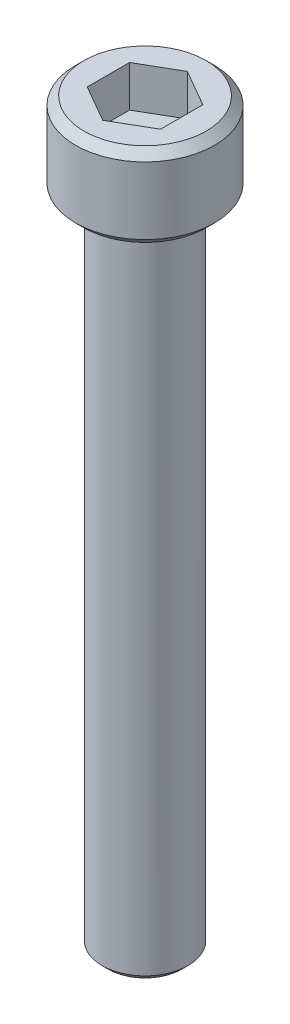
ISO-10303-21;
HEADER;
FILE_DESCRIPTION(('STEP AP214'),'2;1');
FILE_NAME('part.step','',(''),(''),'','','');
FILE_SCHEMA(('AUTOMOTIVE_DESIGN { 1 0 10303 214 1 1 1 1 }'));
ENDSEC;
DATA;
#1=APPLICATION_CONTEXT('core data for automotive mechanical design processes');
#2=APPLICATION_PROTOCOL_DEFINITION('international standard','automotive_design',2000,#1);
#3=PRODUCT_CONTEXT('',#1,'mechanical');
#4=PRODUCT('Part','Part','',(#3));
#5=PRODUCT_RELATED_PRODUCT_CATEGORY('part','',(#4));
#6=PRODUCT_DEFINITION_FORMATION('','',#4);
#7=PRODUCT_DEFINITION_CONTEXT('part definition',#1,'design');
#8=PRODUCT_DEFINITION('design','',#6,#7);
#9=PRODUCT_DEFINITION_SHAPE('','',#8);
#10=(LENGTH_UNIT() NAMED_UNIT(*) SI_UNIT(.MILLI.,.METRE.));
#11=(NAMED_UNIT(*) PLANE_ANGLE_UNIT() SI_UNIT($,.RADIAN.));
#12=(NAMED_UNIT(*) SI_UNIT($,.STERADIAN.) SOLID_ANGLE_UNIT());
#13=UNCERTAINTY_MEASURE_WITH_UNIT(LENGTH_MEASURE(1.E-05),#10,'distance_accuracy_value','');
#14=(GEOMETRIC_REPRESENTATION_CONTEXT(3) GLOBAL_UNCERTAINTY_ASSIGNED_CONTEXT((#13)) GLOBAL_UNIT_ASSIGNED_CONTEXT((#10,
#11,#12)) REPRESENTATION_CONTEXT('',''));
#15=CARTESIAN_POINT('',(0.,0.,0.));
#16=DIRECTION('',(0.,0.,1.));
#17=DIRECTION('',(1.,0.,0.));
#18=AXIS2_PLACEMENT_3D('',#15,#16,#17);
#19=CARTESIAN_POINT('',(1.77799999999999,2.064,3.07958633585744));
#20=DIRECTION('',(0.,1.,0.));
#21=DIRECTION('',(-1.,0.,0.));
#22=AXIS2_PLACEMENT_3D('',#19,#20,#21);
#23=PLANE('',#22);
#24=DIRECTION('',(-0.866025403784438,0.,0.5));
#25=VECTOR('',#24,1.);
#26=CARTESIAN_POINT('',(0.,2.064,-2.05305755723831));
#27=LINE('',#26,#25);
#28=CARTESIAN_POINT('',(0.,2.064,-2.05305755723831));
#29=VERTEX_POINT('',#28);
#30=CARTESIAN_POINT('',(-1.778,2.064,-1.02652877861915));
#31=VERTEX_POINT('',#30);
#32=EDGE_CURVE('E81',#29,#31,#27,.T.);
#33=ORIENTED_EDGE('',*,*,#32,.T.);
#34=DIRECTION('',(0.,0.,1.));
#35=VECTOR('',#34,1.);
#36=CARTESIAN_POINT('',(-1.778,2.064,-1.02652877861915));
#37=LINE('',#36,#35);
#38=CARTESIAN_POINT('',(-1.778,2.064,1.02652877861915));
#39=VERTEX_POINT('',#38);
#40=EDGE_CURVE('E83',#31,#39,#37,.T.);
#41=ORIENTED_EDGE('',*,*,#40,.T.);
#42=DIRECTION('',(0.866025403784439,0.,0.5));
#43=VECTOR('',#42,1.);
#44=CARTESIAN_POINT('',(-1.778,2.064,1.02652877861915));
#45=LINE('',#44,#43);
#46=CARTESIAN_POINT('',(0.,2.064,2.05305755723829));
#47=VERTEX_POINT('',#46);
#48=EDGE_CURVE('E85',#39,#47,#45,.T.);
#49=ORIENTED_EDGE('',*,*,#48,.T.);
#50=DIRECTION('',(0.866025403784438,0.,-0.500000000000001));
#51=VECTOR('',#50,1.);
#52=CARTESIAN_POINT('',(0.,2.064,2.05305755723828));
#53=LINE('',#52,#51);
#54=CARTESIAN_POINT('',(1.77799999999999,2.064,1.02652877861912));
#55=VERTEX_POINT('',#54);
#56=EDGE_CURVE('E159',#47,#55,#53,.T.);
#57=ORIENTED_EDGE('',*,*,#56,.T.);
#58=DIRECTION('',(0.,0.,1.));
#59=VECTOR('',#58,1.);
#60=CARTESIAN_POINT('',(1.77799999999999,2.064,1.02652877861912));
#61=LINE('',#60,#59);
#62=CARTESIAN_POINT('',(1.77799999999999,2.064,-1.02652877861916));
#63=VERTEX_POINT('',#62);
#64=EDGE_CURVE('E167',#55,#63,#61,.F.);
#65=ORIENTED_EDGE('',*,*,#64,.T.);
#66=DIRECTION('',(-0.866025403784439,0.,-0.5));
#67=VECTOR('',#66,1.);
#68=CARTESIAN_POINT('',(1.778,2.064,-1.02652877861916));
#69=LINE('',#68,#67);
#70=EDGE_CURVE('E172',#63,#29,#69,.T.);
#71=ORIENTED_EDGE('',*,*,#70,.T.);
#72=EDGE_LOOP('',(#33,#41,#49,#57,#65,#71));
#73=FACE_BOUND('',#72,.T.);
#74=ADVANCED_FACE('F16',(#73),#23,.T.);
#75=CARTESIAN_POINT('',(-1.778,2.064,1.02652877861915));
#76=DIRECTION('',(-0.5,0.,0.866025403784439));
#77=DIRECTION('',(0.866025403784439,0.,0.5));
#78=AXIS2_PLACEMENT_3D('',#75,#76,#77);
#79=PLANE('',#78);
#80=DIRECTION('',(0.,1.,0.));
#81=VECTOR('',#80,1.);
#82=CARTESIAN_POINT('',(0.,2.064,2.05305755723828));
#83=LINE('',#82,#81);
#84=CARTESIAN_POINT('',(0.,4.064,2.05305755723829));
#85=VERTEX_POINT('',#84);
#86=EDGE_CURVE('E97',#85,#47,#83,.F.);
#87=ORIENTED_EDGE('',*,*,#86,.T.);
#88=ORIENTED_EDGE('',*,*,#48,.F.);
#89=DIRECTION('',(0.,1.,0.));
#90=VECTOR('',#89,1.);
#91=CARTESIAN_POINT('',(-1.778,2.064,1.02652877861915));
#92=LINE('',#91,#90);
#93=CARTESIAN_POINT('',(-1.778,4.064,1.02652877861915));
#94=VERTEX_POINT('',#93);
#95=EDGE_CURVE('E91',#39,#94,#92,.T.);
#96=ORIENTED_EDGE('',*,*,#95,.T.);
#97=DIRECTION('',(-0.866025403784443,0.,-0.499999999999993));
#98=VECTOR('',#97,1.);
#99=CARTESIAN_POINT('',(0.,4.064,2.05305755723828));
#100=LINE('',#99,#98);
#101=EDGE_CURVE('E154',#85,#94,#100,.T.);
#102=ORIENTED_EDGE('',*,*,#101,.F.);
#103=EDGE_LOOP('',(#87,#88,#96,#102));
#104=FACE_BOUND('',#103,.T.);
#105=ADVANCED_FACE('F94',(#104),#79,.F.);
#106=CARTESIAN_POINT('',(-1.778,2.064,-1.02652877861915));
#107=DIRECTION('',(-1.,0.,0.));
#108=DIRECTION('',(0.,0.,1.));
#109=AXIS2_PLACEMENT_3D('',#106,#107,#108);
#110=PLANE('',#109);
#111=ORIENTED_EDGE('',*,*,#95,.F.);
#112=ORIENTED_EDGE('',*,*,#40,.F.);
#113=DIRECTION('',(0.,1.,0.));
#114=VECTOR('',#113,1.);
#115=CARTESIAN_POINT('',(-1.778,2.064,-1.02652877861916));
#116=LINE('',#115,#114);
#117=CARTESIAN_POINT('',(-1.778,4.064,-1.02652877861915));
#118=VERTEX_POINT('',#117);
#119=EDGE_CURVE('E111',#31,#118,#116,.T.);
#120=ORIENTED_EDGE('',*,*,#119,.T.);
#121=DIRECTION('',(0.,0.,1.));
#122=VECTOR('',#121,1.);
#123=CARTESIAN_POINT('',(-1.778,4.064,0.));
#124=LINE('',#123,#122);
#125=EDGE_CURVE('E103',#94,#118,#124,.F.);
#126=ORIENTED_EDGE('',*,*,#125,.F.);
#127=EDGE_LOOP('',(#111,#112,#120,#126));
#128=FACE_BOUND('',#127,.T.);
#129=ADVANCED_FACE('F101',(#128),#110,.F.);
#130=CARTESIAN_POINT('',(0.,2.064,-2.05305755723831));
#131=DIRECTION('',(-0.5,0.,-0.866025403784438));
#132=DIRECTION('',(-0.866025403784438,0.,0.5));
#133=AXIS2_PLACEMENT_3D('',#130,#131,#132);
#134=PLANE('',#133);
#135=ORIENTED_EDGE('',*,*,#119,.F.);
#136=ORIENTED_EDGE('',*,*,#32,.F.);
#137=DIRECTION('',(0.,1.,0.));
#138=VECTOR('',#137,1.);
#139=CARTESIAN_POINT('',(0.,2.064,-2.05305755723831));
#140=LINE('',#139,#138);
#141=CARTESIAN_POINT('',(0.,4.064,-2.05305755723831));
#142=VERTEX_POINT('',#141);
#143=EDGE_CURVE('E170',#29,#142,#140,.T.);
#144=ORIENTED_EDGE('',*,*,#143,.T.);
#145=DIRECTION('',(0.866025403784438,0.,-0.500000000000001));
#146=VECTOR('',#145,1.);
#147=CARTESIAN_POINT('',(-1.778,4.064,-1.02652877861915));
#148=LINE('',#147,#146);
#149=EDGE_CURVE('E148',#118,#142,#148,.T.);
#150=ORIENTED_EDGE('',*,*,#149,.F.);
#151=EDGE_LOOP('',(#135,#136,#144,#150));
#152=FACE_BOUND('',#151,.T.);
#153=ADVANCED_FACE('F176',(#152),#134,.F.);
#154=CARTESIAN_POINT('',(1.778,2.064,-1.02652877861916));
#155=DIRECTION('',(0.5,0.,-0.866025403784439));
#156=DIRECTION('',(-0.866025403784439,0.,-0.5));
#157=AXIS2_PLACEMENT_3D('',#154,#155,#156);
#158=PLANE('',#157);
#159=ORIENTED_EDGE('',*,*,#143,.F.);
#160=ORIENTED_EDGE('',*,*,#70,.F.);
#161=DIRECTION('',(0.,1.,0.));
#162=VECTOR('',#161,1.);
#163=CARTESIAN_POINT('',(1.77799999999999,2.064,-1.02652877861916));
#164=LINE('',#163,#162);
#165=CARTESIAN_POINT('',(1.77799999999999,4.064,-1.02652877861916));
#166=VERTEX_POINT('',#165);
#167=EDGE_CURVE('E164',#63,#166,#164,.T.);
#168=ORIENTED_EDGE('',*,*,#167,.T.);
#169=DIRECTION('',(0.86602540378444,0.,0.499999999999997));
#170=VECTOR('',#169,1.);
#171=CARTESIAN_POINT('',(0.,4.064,-2.05305755723831));
#172=LINE('',#171,#170);
#173=EDGE_CURVE('E145',#142,#166,#172,.T.);
#174=ORIENTED_EDGE('',*,*,#173,.F.);
#175=EDGE_LOOP('',(#159,#160,#168,#174));
#176=FACE_BOUND('',#175,.T.);
#177=ADVANCED_FACE('F188',(#176),#158,.F.);
#178=CARTESIAN_POINT('',(1.77799999999999,2.064,1.02652877861912));
#179=DIRECTION('',(1.,0.,0.));
#180=DIRECTION('',(0.,1.,0.));
#181=AXIS2_PLACEMENT_3D('',#178,#179,#180);
#182=PLANE('',#181);
#183=ORIENTED_EDGE('',*,*,#167,.F.);
#184=ORIENTED_EDGE('',*,*,#64,.F.);
#185=DIRECTION('',(0.,1.,0.));
#186=VECTOR('',#185,1.);
#187=CARTESIAN_POINT('',(1.77799999999999,2.064,1.02652877861912));
#188=LINE('',#187,#186);
#189=CARTESIAN_POINT('',(1.77799999999999,4.064,1.02652877861912));
#190=VERTEX_POINT('',#189);
#191=EDGE_CURVE('E38',#55,#190,#188,.T.);
#192=ORIENTED_EDGE('',*,*,#191,.T.);
#193=DIRECTION('',(0.,0.,1.));
#194=VECTOR('',#193,1.);
#195=CARTESIAN_POINT('',(1.778,4.064,0.));
#196=LINE('',#195,#194);
#197=EDGE_CURVE('E141',#166,#190,#196,.T.);
#198=ORIENTED_EDGE('',*,*,#197,.F.);
#199=EDGE_LOOP('',(#183,#184,#192,#198));
#200=FACE_BOUND('',#199,.T.);
#201=ADVANCED_FACE('F186',(#200),#182,.F.);
#202=CARTESIAN_POINT('',(0.,2.064,2.05305755723828));
#203=DIRECTION('',(0.500000000000001,0.,0.866025403784438));
#204=DIRECTION('',(0.866025403784438,0.,-0.500000000000001));
#205=AXIS2_PLACEMENT_3D('',#202,#203,#204);
#206=PLANE('',#205);
#207=ORIENTED_EDGE('',*,*,#191,.F.);
#208=ORIENTED_EDGE('',*,*,#56,.F.);
#209=ORIENTED_EDGE('',*,*,#86,.F.);
#210=DIRECTION('',(-0.866025403784437,0.,0.500000000000002));
#211=VECTOR('',#210,1.);
#212=CARTESIAN_POINT('',(1.77799999999999,4.064,1.02652877861912));
#213=LINE('',#212,#211);
#214=EDGE_CURVE('E137',#190,#85,#213,.T.);
#215=ORIENTED_EDGE('',*,*,#214,.F.);
#216=EDGE_LOOP('',(#207,#208,#209,#215));
#217=FACE_BOUND('',#216,.T.);
#218=ADVANCED_FACE('F183',(#217),#206,.F.);
#219=CARTESIAN_POINT('',(0.,4.064,0.));
#220=DIRECTION('',(0.,1.,0.));
#221=DIRECTION('',(-1.,0.,0.));
#222=AXIS2_PLACEMENT_3D('',#219,#220,#221);
#223=PLANE('',#222);
#224=ORIENTED_EDGE('',*,*,#197,.T.);
#225=ORIENTED_EDGE('',*,*,#214,.T.);
#226=ORIENTED_EDGE('',*,*,#101,.T.);
#227=ORIENTED_EDGE('',*,*,#125,.T.);
#228=ORIENTED_EDGE('',*,*,#149,.T.);
#229=ORIENTED_EDGE('',*,*,#173,.T.);
#230=EDGE_LOOP('',(#224,#225,#226,#227,#228,#229));
#231=FACE_BOUND('',#230,.T.);
#232=CARTESIAN_POINT('',(0.,4.06400000002805,0.));
#233=DIRECTION('',(0.,-1.,0.));
#234=DIRECTION('',(0.,0.,-1.));
#235=AXIS2_PLACEMENT_3D('',#232,#233,#234);
#236=CIRCLE('',#235,2.96550000001616);
#237=CARTESIAN_POINT('',(0.,4.06400000002805,-2.96550000001616));
#238=VERTEX_POINT('',#237);
#239=EDGE_CURVE('E19',#238,#238,#236,.T.);
#240=ORIENTED_EDGE('',*,*,#239,.F.);
#241=EDGE_LOOP('',(#240));
#242=FACE_BOUND('',#241,.T.);
#243=ADVANCED_FACE('F180',(#231,#242),#223,.T.);
#244=CARTESIAN_POINT('',(0.,3.6640000001853,0.));
#245=DIRECTION('',(0.,-1.,0.));
#246=DIRECTION('',(0.,0.,-1.));
#247=AXIS2_PLACEMENT_3D('',#244,#245,#246);
#248=CONICAL_SURFACE('',#247,3.36549999991576,0.785398163468503);
#249=ORIENTED_EDGE('',*,*,#239,.T.);
#250=EDGE_LOOP('',(#249));
#251=FACE_BOUND('',#250,.T.);
#252=CARTESIAN_POINT('',(0.,3.664,0.));
#253=DIRECTION('',(0.,-1.,0.));
#254=DIRECTION('',(1.,0.,0.));
#255=AXIS2_PLACEMENT_3D('',#252,#253,#254);
#256=CIRCLE('',#255,3.36549999999999);
#257=CARTESIAN_POINT('',(3.36549999999999,3.664,0.));
#258=VERTEX_POINT('',#257);
#259=EDGE_CURVE('E128',#258,#258,#256,.T.);
#260=ORIENTED_EDGE('',*,*,#259,.F.);
#261=EDGE_LOOP('',(#260));
#262=FACE_BOUND('',#261,.T.);
#263=ADVANCED_FACE('F225',(#251,#262),#248,.T.);
#264=CARTESIAN_POINT('',(0.,4.064,0.));
#265=DIRECTION('',(0.,-1.,0.));
#266=DIRECTION('',(1.,0.,0.));
#267=AXIS2_PLACEMENT_3D('',#264,#265,#266);
#268=CYLINDRICAL_SURFACE('',#267,3.36549999999999);
#269=ORIENTED_EDGE('',*,*,#259,.T.);
#270=EDGE_LOOP('',(#269));
#271=FACE_BOUND('',#270,.T.);
#272=CARTESIAN_POINT('',(0.,0.400000000013279,0.));
#273=DIRECTION('',(0.,1.,0.));
#274=DIRECTION('',(0.,0.,1.));
#275=AXIS2_PLACEMENT_3D('',#272,#273,#274);
#276=CIRCLE('',#275,3.36550000002944);
#277=CARTESIAN_POINT('',(0.,0.400000000013279,3.36550000002944));
#278=VERTEX_POINT('',#277);
#279=EDGE_CURVE('E121',#278,#278,#276,.F.);
#280=ORIENTED_EDGE('',*,*,#279,.F.);
#281=EDGE_LOOP('',(#280));
#282=FACE_BOUND('',#281,.T.);
#283=ADVANCED_FACE('F221',(#271,#282),#268,.T.);
#284=CARTESIAN_POINT('',(0.,-31.75,0.));
#285=DIRECTION('',(0.,1.,0.));
#286=DIRECTION('',(-1.,0.,0.));
#287=AXIS2_PLACEMENT_3D('',#284,#285,#286);
#288=PLANE('',#287);
#289=CARTESIAN_POINT('',(0.,-31.7499999999313,0.));
#290=DIRECTION('',(0.,1.,0.));
#291=DIRECTION('',(0.,0.,1.));
#292=AXIS2_PLACEMENT_3D('',#289,#290,#291);
#293=CIRCLE('',#292,1.78279999994402);
#294=CARTESIAN_POINT('',(0.,-31.7499999999313,1.78279999994402));
#295=VERTEX_POINT('',#294);
#296=EDGE_CURVE('E118',#295,#295,#293,.T.);
#297=ORIENTED_EDGE('',*,*,#296,.F.);
#298=EDGE_LOOP('',(#297));
#299=FACE_BOUND('',#298,.T.);
#300=ADVANCED_FACE('F217',(#299),#288,.F.);
#301=CARTESIAN_POINT('',(0.,0.400000000013279,0.));
#302=DIRECTION('',(0.,1.,0.));
#303=DIRECTION('',(0.,0.,1.));
#304=AXIS2_PLACEMENT_3D('',#301,#302,#303);
#305=CONICAL_SURFACE('',#304,3.36550000002944,0.785398163397448);
#306=CARTESIAN_POINT('',(0.,0.,0.));
#307=DIRECTION('',(0.,1.,0.));
#308=DIRECTION('',(0.,0.,1.));
#309=AXIS2_PLACEMENT_3D('',#306,#307,#308);
#310=CIRCLE('',#309,2.96550000001616);
#311=CARTESIAN_POINT('',(0.,0.,2.96550000001616));
#312=VERTEX_POINT('',#311);
#313=EDGE_CURVE('E115',#312,#312,#310,.T.);
#314=ORIENTED_EDGE('',*,*,#313,.T.);
#315=EDGE_LOOP('',(#314));
#316=FACE_BOUND('',#315,.T.);
#317=ORIENTED_EDGE('',*,*,#279,.T.);
#318=EDGE_LOOP('',(#317));
#319=FACE_BOUND('',#318,.T.);
#320=ADVANCED_FACE('F214',(#316,#319),#305,.T.);
#321=CARTESIAN_POINT('',(0.,-31.4500000000066,0.));
#322=DIRECTION('',(0.,1.,0.));
#323=DIRECTION('',(0.,0.,1.));
#324=AXIS2_PLACEMENT_3D('',#321,#322,#323);
#325=CONICAL_SURFACE('',#324,2.08279999992556,0.785398163492187);
#326=ORIENTED_EDGE('',*,*,#296,.T.);
#327=EDGE_LOOP('',(#326));
#328=FACE_BOUND('',#327,.T.);
#329=CARTESIAN_POINT('',(0.,-31.45,0.));
#330=DIRECTION('',(0.,1.,0.));
#331=DIRECTION('',(-1.,0.,0.));
#332=AXIS2_PLACEMENT_3D('',#329,#330,#331);
#333=CIRCLE('',#332,2.0828);
#334=CARTESIAN_POINT('',(-2.0828,-31.45,0.));
#335=VERTEX_POINT('',#334);
#336=EDGE_CURVE('E26',#335,#335,#333,.T.);
#337=ORIENTED_EDGE('',*,*,#336,.F.);
#338=EDGE_LOOP('',(#337));
#339=FACE_BOUND('',#338,.T.);
#340=ADVANCED_FACE('F206',(#328,#339),#325,.T.);
#341=CARTESIAN_POINT('',(0.,0.,0.));
#342=DIRECTION('',(0.,1.,0.));
#343=DIRECTION('',(-1.,0.,0.));
#344=AXIS2_PLACEMENT_3D('',#341,#342,#343);
#345=PLANE('',#344);
#346=CARTESIAN_POINT('',(0.,0.,0.));
#347=DIRECTION('',(0.,1.,0.));
#348=DIRECTION('',(-1.,0.,0.));
#349=AXIS2_PLACEMENT_3D('',#346,#347,#348);
#350=CIRCLE('',#349,2.0828);
#351=CARTESIAN_POINT('',(-2.0828,0.,0.));
#352=VERTEX_POINT('',#351);
#353=EDGE_CURVE('E11',#352,#352,#350,.F.);
#354=ORIENTED_EDGE('',*,*,#353,.F.);
#355=EDGE_LOOP('',(#354));
#356=FACE_BOUND('',#355,.T.);
#357=ORIENTED_EDGE('',*,*,#313,.F.);
#358=EDGE_LOOP('',(#357));
#359=FACE_BOUND('',#358,.T.);
#360=ADVANCED_FACE('F200',(#356,#359),#345,.F.);
#361=CARTESIAN_POINT('',(0.,-31.75,0.));
#362=DIRECTION('',(0.,1.,0.));
#363=DIRECTION('',(-1.,0.,0.));
#364=AXIS2_PLACEMENT_3D('',#361,#362,#363);
#365=CYLINDRICAL_SURFACE('',#364,2.0828);
#366=ORIENTED_EDGE('',*,*,#336,.T.);
#367=EDGE_LOOP('',(#366));
#368=FACE_BOUND('',#367,.T.);
#369=ORIENTED_EDGE('',*,*,#353,.T.);
#370=EDGE_LOOP('',(#369));
#371=FACE_BOUND('',#370,.T.);
#372=ADVANCED_FACE('F198',(#368,#371),#365,.T.);
#373=CLOSED_SHELL('',(#74,#105,#129,#153,#177,#201,#218,#243,#263,#283,#300,#320,#340,#360,#372));
#374=MANIFOLD_SOLID_BREP('B1',#373);
#375=ADVANCED_BREP_SHAPE_REPRESENTATION('',(#18,#374),#14);
#376=SHAPE_DEFINITION_REPRESENTATION(#9,#375);
ENDSEC;
END-ISO-10303-21;
